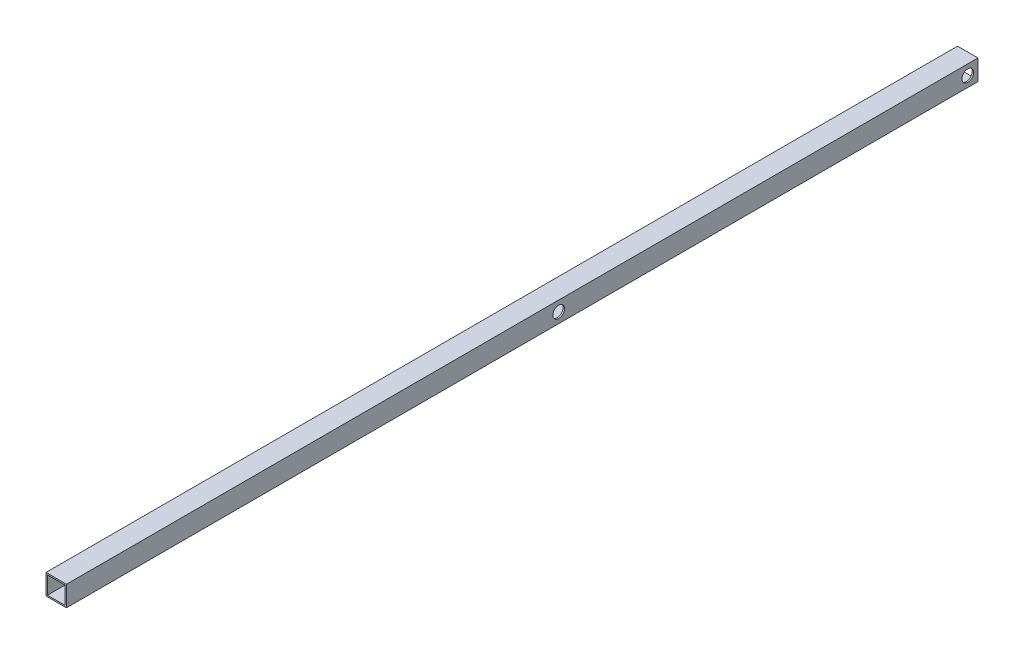
ISO-10303-21;
HEADER;
FILE_DESCRIPTION(('STEP AP214'),'2;1');
FILE_NAME('part.step','',(''),(''),'','','');
FILE_SCHEMA(('AUTOMOTIVE_DESIGN { 1 0 10303 214 1 1 1 1 }'));
ENDSEC;
DATA;
#1=APPLICATION_CONTEXT('core data for automotive mechanical design processes');
#2=APPLICATION_PROTOCOL_DEFINITION('international standard','automotive_design',2000,#1);
#3=PRODUCT_CONTEXT('',#1,'mechanical');
#4=PRODUCT('Part','Part','',(#3));
#5=PRODUCT_RELATED_PRODUCT_CATEGORY('part','',(#4));
#6=PRODUCT_DEFINITION_FORMATION('','',#4);
#7=PRODUCT_DEFINITION_CONTEXT('part definition',#1,'design');
#8=PRODUCT_DEFINITION('design','',#6,#7);
#9=PRODUCT_DEFINITION_SHAPE('','',#8);
#10=(LENGTH_UNIT() NAMED_UNIT(*) SI_UNIT(.MILLI.,.METRE.));
#11=(NAMED_UNIT(*) PLANE_ANGLE_UNIT() SI_UNIT($,.RADIAN.));
#12=(NAMED_UNIT(*) SI_UNIT($,.STERADIAN.) SOLID_ANGLE_UNIT());
#13=UNCERTAINTY_MEASURE_WITH_UNIT(LENGTH_MEASURE(1.E-05),#10,'distance_accuracy_value','');
#14=(GEOMETRIC_REPRESENTATION_CONTEXT(3) GLOBAL_UNCERTAINTY_ASSIGNED_CONTEXT((#13)) GLOBAL_UNIT_ASSIGNED_CONTEXT((#10,
#11,#12)) REPRESENTATION_CONTEXT('',''));
#15=CARTESIAN_POINT('',(0.,0.,0.));
#16=DIRECTION('',(0.,0.,1.));
#17=DIRECTION('',(1.,0.,0.));
#18=AXIS2_PLACEMENT_3D('',#15,#16,#17);
#19=CARTESIAN_POINT('',(13.1321710093077,0.25561907476954,911.225));
#20=DIRECTION('',(-1.,0.,0.));
#21=DIRECTION('',(0.,-1.,0.));
#22=AXIS2_PLACEMENT_3D('',#19,#20,#21);
#23=CYLINDRICAL_SURFACE('',#22,18.25625);
#24=CARTESIAN_POINT('',(-31.3178289906922,0.255619074769538,911.225));
#25=DIRECTION('',(-1.,0.,0.));
#26=DIRECTION('',(0.,-1.,0.));
#27=AXIS2_PLACEMENT_3D('',#24,#25,#26);
#28=CIRCLE('',#27,18.25625);
#29=CARTESIAN_POINT('',(-31.3178289906922,-18.0006309252305,911.225));
#30=VERTEX_POINT('',#29);
#31=EDGE_CURVE('E131',#30,#30,#28,.F.);
#32=ORIENTED_EDGE('',*,*,#31,.F.);
#33=EDGE_LOOP('',(#32));
#34=FACE_BOUND('',#33,.T.);
#35=CARTESIAN_POINT('',(-28.1428289906922,0.255619074769538,911.225));
#36=DIRECTION('',(-1.,0.,0.));
#37=DIRECTION('',(0.,-1.,0.));
#38=AXIS2_PLACEMENT_3D('',#35,#36,#37);
#39=CIRCLE('',#38,18.25625);
#40=CARTESIAN_POINT('',(-28.1428289906922,-18.0006309252305,911.225));
#41=VERTEX_POINT('',#40);
#42=EDGE_CURVE('E20',#41,#41,#39,.F.);
#43=ORIENTED_EDGE('',*,*,#42,.T.);
#44=EDGE_LOOP('',(#43));
#45=FACE_BOUND('',#44,.T.);
#46=ADVANCED_FACE('F17',(#34,#45),#23,.F.);
#47=CARTESIAN_POINT('',(13.1321710093077,0.25561907476954,22.225));
#48=DIRECTION('',(-1.,0.,0.));
#49=DIRECTION('',(0.,-1.,0.));
#50=AXIS2_PLACEMENT_3D('',#47,#48,#49);
#51=CYLINDRICAL_SURFACE('',#50,18.25625);
#52=CARTESIAN_POINT('',(-31.3178289906922,0.255619074769538,22.225));
#53=DIRECTION('',(-1.,0.,0.));
#54=DIRECTION('',(0.,-1.,0.));
#55=AXIS2_PLACEMENT_3D('',#52,#53,#54);
#56=CIRCLE('',#55,18.25625);
#57=CARTESIAN_POINT('',(-31.3178289906922,-18.0006309252305,22.225));
#58=VERTEX_POINT('',#57);
#59=EDGE_CURVE('E127',#58,#58,#56,.F.);
#60=ORIENTED_EDGE('',*,*,#59,.F.);
#61=EDGE_LOOP('',(#60));
#62=FACE_BOUND('',#61,.T.);
#63=CARTESIAN_POINT('',(-28.1428289906922,0.255619074769538,22.225));
#64=DIRECTION('',(-1.,0.,0.));
#65=DIRECTION('',(0.,-1.,0.));
#66=AXIS2_PLACEMENT_3D('',#63,#64,#65);
#67=CIRCLE('',#66,18.25625);
#68=CARTESIAN_POINT('',(-28.1428289906922,-18.0006309252305,22.225));
#69=VERTEX_POINT('',#68);
#70=EDGE_CURVE('E118',#69,#69,#67,.F.);
#71=ORIENTED_EDGE('',*,*,#70,.T.);
#72=EDGE_LOOP('',(#71));
#73=FACE_BOUND('',#72,.T.);
#74=ADVANCED_FACE('F149',(#62,#73),#51,.F.);
#75=CARTESIAN_POINT('',(-28.1428289906922,-21.9693809252305,0.));
#76=DIRECTION('',(-1.,0.,0.));
#77=DIRECTION('',(0.,0.,1.));
#78=AXIS2_PLACEMENT_3D('',#75,#76,#77);
#79=PLANE('',#78);
#80=ORIENTED_EDGE('',*,*,#70,.F.);
#81=EDGE_LOOP('',(#80));
#82=FACE_BOUND('',#81,.T.);
#83=ORIENTED_EDGE('',*,*,#42,.F.);
#84=EDGE_LOOP('',(#83));
#85=FACE_BOUND('',#84,.T.);
#86=DIRECTION('',(0.,1.,0.));
#87=VECTOR('',#86,1.);
#88=CARTESIAN_POINT('',(-28.1428289906922,0.25561907476954,0.));
#89=LINE('',#88,#87);
#90=CARTESIAN_POINT('',(-28.1428289906922,-18.7943809252305,0.));
#91=VERTEX_POINT('',#90);
#92=CARTESIAN_POINT('',(-28.1428289906922,19.3056190747695,0.));
#93=VERTEX_POINT('',#92);
#94=EDGE_CURVE('E106',#91,#93,#89,.T.);
#95=ORIENTED_EDGE('',*,*,#94,.T.);
#96=DIRECTION('',(0.,0.,1.));
#97=VECTOR('',#96,1.);
#98=CARTESIAN_POINT('',(-28.1428289906922,19.3056190747695,0.));
#99=LINE('',#98,#97);
#100=CARTESIAN_POINT('',(-28.1428289906922,19.3056190747695,1981.2));
#101=VERTEX_POINT('',#100);
#102=EDGE_CURVE('E116',#93,#101,#99,.T.);
#103=ORIENTED_EDGE('',*,*,#102,.T.);
#104=DIRECTION('',(0.,1.,0.));
#105=VECTOR('',#104,1.);
#106=CARTESIAN_POINT('',(-28.1428289906922,0.25561907476954,1981.2));
#107=LINE('',#106,#105);
#108=CARTESIAN_POINT('',(-28.1428289906922,-18.7943809252305,1981.2));
#109=VERTEX_POINT('',#108);
#110=EDGE_CURVE('E167',#109,#101,#107,.T.);
#111=ORIENTED_EDGE('',*,*,#110,.F.);
#112=DIRECTION('',(0.,0.,-1.));
#113=VECTOR('',#112,1.);
#114=CARTESIAN_POINT('',(-28.1428289906922,-18.7943809252305,0.));
#115=LINE('',#114,#113);
#116=EDGE_CURVE('E102',#109,#91,#115,.T.);
#117=ORIENTED_EDGE('',*,*,#116,.T.);
#118=EDGE_LOOP('',(#95,#103,#111,#117));
#119=FACE_BOUND('',#118,.T.);
#120=ADVANCED_FACE('F145',(#82,#85,#119),#79,.F.);
#121=CARTESIAN_POINT('',(-31.3178289906922,19.3056190747695,0.));
#122=DIRECTION('',(0.,1.,0.));
#123=DIRECTION('',(0.,0.,1.));
#124=AXIS2_PLACEMENT_3D('',#121,#122,#123);
#125=PLANE('',#124);
#126=DIRECTION('',(1.,0.,0.));
#127=VECTOR('',#126,1.);
#128=CARTESIAN_POINT('',(-9.09282899069231,19.3056190747695,0.));
#129=LINE('',#128,#127);
#130=CARTESIAN_POINT('',(9.95717100930769,19.3056190747695,0.));
#131=VERTEX_POINT('',#130);
#132=EDGE_CURVE('E108',#93,#131,#129,.T.);
#133=ORIENTED_EDGE('',*,*,#132,.T.);
#134=DIRECTION('',(0.,0.,-1.));
#135=VECTOR('',#134,1.);
#136=CARTESIAN_POINT('',(9.95717100930769,19.3056190747695,0.));
#137=LINE('',#136,#135);
#138=CARTESIAN_POINT('',(9.95717100930769,19.3056190747695,1981.2));
#139=VERTEX_POINT('',#138);
#140=EDGE_CURVE('E79',#131,#139,#137,.F.);
#141=ORIENTED_EDGE('',*,*,#140,.T.);
#142=DIRECTION('',(1.,0.,0.));
#143=VECTOR('',#142,1.);
#144=CARTESIAN_POINT('',(-9.09282899069231,19.3056190747695,1981.2));
#145=LINE('',#144,#143);
#146=EDGE_CURVE('E156',#101,#139,#145,.T.);
#147=ORIENTED_EDGE('',*,*,#146,.F.);
#148=ORIENTED_EDGE('',*,*,#102,.F.);
#149=EDGE_LOOP('',(#133,#141,#147,#148));
#150=FACE_BOUND('',#149,.T.);
#151=ADVANCED_FACE('F148',(#150),#125,.F.);
#152=CARTESIAN_POINT('',(9.95717100930769,22.4806190747695,0.));
#153=DIRECTION('',(1.,0.,0.));
#154=DIRECTION('',(0.,0.,-1.));
#155=AXIS2_PLACEMENT_3D('',#152,#153,#154);
#156=PLANE('',#155);
#157=CARTESIAN_POINT('',(9.95717100930769,0.25561907476954,22.225));
#158=DIRECTION('',(-1.,0.,0.));
#159=DIRECTION('',(0.,-1.,0.));
#160=AXIS2_PLACEMENT_3D('',#157,#158,#159);
#161=CIRCLE('',#160,12.7);
#162=CARTESIAN_POINT('',(9.95717100930769,-12.4443809252305,22.225));
#163=VERTEX_POINT('',#162);
#164=EDGE_CURVE('E112',#163,#163,#161,.F.);
#165=ORIENTED_EDGE('',*,*,#164,.T.);
#166=EDGE_LOOP('',(#165));
#167=FACE_BOUND('',#166,.T.);
#168=CARTESIAN_POINT('',(9.95717100930769,0.25561907476954,911.225));
#169=DIRECTION('',(-1.,0.,0.));
#170=DIRECTION('',(0.,-1.,0.));
#171=AXIS2_PLACEMENT_3D('',#168,#169,#170);
#172=CIRCLE('',#171,12.7);
#173=CARTESIAN_POINT('',(9.95717100930769,-12.4443809252305,911.225));
#174=VERTEX_POINT('',#173);
#175=EDGE_CURVE('E101',#174,#174,#172,.F.);
#176=ORIENTED_EDGE('',*,*,#175,.T.);
#177=EDGE_LOOP('',(#176));
#178=FACE_BOUND('',#177,.T.);
#179=DIRECTION('',(0.,1.,0.));
#180=VECTOR('',#179,1.);
#181=CARTESIAN_POINT('',(9.95717100930769,0.25561907476954,0.));
#182=LINE('',#181,#180);
#183=CARTESIAN_POINT('',(9.95717100930769,-18.7943809252305,0.));
#184=VERTEX_POINT('',#183);
#185=EDGE_CURVE('E82',#131,#184,#182,.F.);
#186=ORIENTED_EDGE('',*,*,#185,.T.);
#187=DIRECTION('',(0.,0.,-1.));
#188=VECTOR('',#187,1.);
#189=CARTESIAN_POINT('',(9.95717100930769,-18.7943809252305,0.));
#190=LINE('',#189,#188);
#191=CARTESIAN_POINT('',(9.95717100930769,-18.7943809252305,1981.2));
#192=VERTEX_POINT('',#191);
#193=EDGE_CURVE('E85',#184,#192,#190,.F.);
#194=ORIENTED_EDGE('',*,*,#193,.T.);
#195=DIRECTION('',(0.,1.,0.));
#196=VECTOR('',#195,1.);
#197=CARTESIAN_POINT('',(9.95717100930769,0.25561907476954,1981.2));
#198=LINE('',#197,#196);
#199=EDGE_CURVE('E170',#139,#192,#198,.F.);
#200=ORIENTED_EDGE('',*,*,#199,.F.);
#201=ORIENTED_EDGE('',*,*,#140,.F.);
#202=EDGE_LOOP('',(#186,#194,#200,#201));
#203=FACE_BOUND('',#202,.T.);
#204=ADVANCED_FACE('F84',(#167,#178,#203),#156,.F.);
#205=CARTESIAN_POINT('',(13.1321710093077,-18.7943809252305,0.));
#206=DIRECTION('',(0.,-1.,0.));
#207=DIRECTION('',(0.,0.,-1.));
#208=AXIS2_PLACEMENT_3D('',#205,#206,#207);
#209=PLANE('',#208);
#210=DIRECTION('',(1.,0.,0.));
#211=VECTOR('',#210,1.);
#212=CARTESIAN_POINT('',(-9.09282899069231,-18.7943809252305,0.));
#213=LINE('',#212,#211);
#214=EDGE_CURVE('E90',#184,#91,#213,.F.);
#215=ORIENTED_EDGE('',*,*,#214,.T.);
#216=ORIENTED_EDGE('',*,*,#116,.F.);
#217=DIRECTION('',(1.,0.,0.));
#218=VECTOR('',#217,1.);
#219=CARTESIAN_POINT('',(-9.09282899069231,-18.7943809252305,1981.2));
#220=LINE('',#219,#218);
#221=EDGE_CURVE('E99',#192,#109,#220,.F.);
#222=ORIENTED_EDGE('',*,*,#221,.F.);
#223=ORIENTED_EDGE('',*,*,#193,.F.);
#224=EDGE_LOOP('',(#215,#216,#222,#223));
#225=FACE_BOUND('',#224,.T.);
#226=ADVANCED_FACE('F95',(#225),#209,.F.);
#227=CARTESIAN_POINT('',(13.1321710093077,-21.9693809252305,0.));
#228=DIRECTION('',(0.,-1.,0.));
#229=DIRECTION('',(0.,0.,-1.));
#230=AXIS2_PLACEMENT_3D('',#227,#228,#229);
#231=PLANE('',#230);
#232=DIRECTION('',(1.,0.,0.));
#233=VECTOR('',#232,1.);
#234=CARTESIAN_POINT('',(-9.09282899069231,-21.9693809252305,1981.2));
#235=LINE('',#234,#233);
#236=CARTESIAN_POINT('',(-31.3178289906922,-21.9693809252305,1981.2));
#237=VERTEX_POINT('',#236);
#238=CARTESIAN_POINT('',(13.1321710093077,-21.9693809252305,1981.2));
#239=VERTEX_POINT('',#238);
#240=EDGE_CURVE('E165',#237,#239,#235,.T.);
#241=ORIENTED_EDGE('',*,*,#240,.F.);
#242=DIRECTION('',(0.,0.,1.));
#243=VECTOR('',#242,1.);
#244=CARTESIAN_POINT('',(-31.3178289906922,-21.9693809252305,0.));
#245=LINE('',#244,#243);
#246=CARTESIAN_POINT('',(-31.3178289906922,-21.9693809252305,0.));
#247=VERTEX_POINT('',#246);
#248=EDGE_CURVE('E134',#247,#237,#245,.T.);
#249=ORIENTED_EDGE('',*,*,#248,.F.);
#250=DIRECTION('',(1.,0.,0.));
#251=VECTOR('',#250,1.);
#252=CARTESIAN_POINT('',(-9.09282899069231,-21.9693809252305,0.));
#253=LINE('',#252,#251);
#254=CARTESIAN_POINT('',(13.1321710093077,-21.9693809252305,0.));
#255=VERTEX_POINT('',#254);
#256=EDGE_CURVE('E91',#247,#255,#253,.T.);
#257=ORIENTED_EDGE('',*,*,#256,.T.);
#258=DIRECTION('',(0.,0.,-1.));
#259=VECTOR('',#258,1.);
#260=CARTESIAN_POINT('',(13.1321710093077,-21.9693809252305,0.));
#261=LINE('',#260,#259);
#262=EDGE_CURVE('E126',#239,#255,#261,.T.);
#263=ORIENTED_EDGE('',*,*,#262,.F.);
#264=EDGE_LOOP('',(#241,#249,#257,#263));
#265=FACE_BOUND('',#264,.T.);
#266=ADVANCED_FACE('F195',(#265),#231,.T.);
#267=CARTESIAN_POINT('',(13.1321710093077,0.25561907476954,911.225));
#268=DIRECTION('',(-1.,0.,0.));
#269=DIRECTION('',(0.,-1.,0.));
#270=AXIS2_PLACEMENT_3D('',#267,#268,#269);
#271=CYLINDRICAL_SURFACE('',#270,12.7);
#272=ORIENTED_EDGE('',*,*,#175,.F.);
#273=EDGE_LOOP('',(#272));
#274=FACE_BOUND('',#273,.T.);
#275=CARTESIAN_POINT('',(13.1321710093077,0.25561907476954,911.225));
#276=DIRECTION('',(-1.,0.,0.));
#277=DIRECTION('',(0.,-1.,0.));
#278=AXIS2_PLACEMENT_3D('',#275,#276,#277);
#279=CIRCLE('',#278,12.7);
#280=CARTESIAN_POINT('',(13.1321710093077,-12.4443809252305,911.225));
#281=VERTEX_POINT('',#280);
#282=EDGE_CURVE('E123',#281,#281,#279,.T.);
#283=ORIENTED_EDGE('',*,*,#282,.F.);
#284=EDGE_LOOP('',(#283));
#285=FACE_BOUND('',#284,.T.);
#286=ADVANCED_FACE('F209',(#274,#285),#271,.F.);
#287=CARTESIAN_POINT('',(13.1321710093077,0.25561907476954,22.225));
#288=DIRECTION('',(-1.,0.,0.));
#289=DIRECTION('',(0.,-1.,0.));
#290=AXIS2_PLACEMENT_3D('',#287,#288,#289);
#291=CYLINDRICAL_SURFACE('',#290,12.7);
#292=ORIENTED_EDGE('',*,*,#164,.F.);
#293=EDGE_LOOP('',(#292));
#294=FACE_BOUND('',#293,.T.);
#295=CARTESIAN_POINT('',(13.1321710093077,0.25561907476954,22.225));
#296=DIRECTION('',(-1.,0.,0.));
#297=DIRECTION('',(0.,-1.,0.));
#298=AXIS2_PLACEMENT_3D('',#295,#296,#297);
#299=CIRCLE('',#298,12.7);
#300=CARTESIAN_POINT('',(13.1321710093077,-12.4443809252305,22.225));
#301=VERTEX_POINT('',#300);
#302=EDGE_CURVE('E119',#301,#301,#299,.T.);
#303=ORIENTED_EDGE('',*,*,#302,.F.);
#304=EDGE_LOOP('',(#303));
#305=FACE_BOUND('',#304,.T.);
#306=ADVANCED_FACE('F200',(#294,#305),#291,.F.);
#307=CARTESIAN_POINT('',(-9.09282899069231,0.25561907476954,0.));
#308=DIRECTION('',(0.,0.,1.));
#309=DIRECTION('',(1.,0.,0.));
#310=AXIS2_PLACEMENT_3D('',#307,#308,#309);
#311=PLANE('',#310);
#312=ORIENTED_EDGE('',*,*,#94,.F.);
#313=ORIENTED_EDGE('',*,*,#214,.F.);
#314=ORIENTED_EDGE('',*,*,#185,.F.);
#315=ORIENTED_EDGE('',*,*,#132,.F.);
#316=EDGE_LOOP('',(#312,#313,#314,#315));
#317=FACE_BOUND('',#316,.T.);
#318=ORIENTED_EDGE('',*,*,#256,.F.);
#319=DIRECTION('',(0.,1.,0.));
#320=VECTOR('',#319,1.);
#321=CARTESIAN_POINT('',(-31.3178289906922,-21.9693809252305,0.));
#322=LINE('',#321,#320);
#323=CARTESIAN_POINT('',(-31.3178289906922,22.4806190747695,0.));
#324=VERTEX_POINT('',#323);
#325=EDGE_CURVE('E158',#324,#247,#322,.F.);
#326=ORIENTED_EDGE('',*,*,#325,.F.);
#327=DIRECTION('',(1.,0.,0.));
#328=VECTOR('',#327,1.);
#329=CARTESIAN_POINT('',(-31.3178289906922,22.4806190747695,0.));
#330=LINE('',#329,#328);
#331=CARTESIAN_POINT('',(13.1321710093077,22.4806190747695,0.));
#332=VERTEX_POINT('',#331);
#333=EDGE_CURVE('E122',#332,#324,#330,.F.);
#334=ORIENTED_EDGE('',*,*,#333,.F.);
#335=DIRECTION('',(0.,1.,0.));
#336=VECTOR('',#335,1.);
#337=CARTESIAN_POINT('',(13.1321710093077,22.4806190747695,0.));
#338=LINE('',#337,#336);
#339=EDGE_CURVE('E173',#255,#332,#338,.T.);
#340=ORIENTED_EDGE('',*,*,#339,.F.);
#341=EDGE_LOOP('',(#318,#326,#334,#340));
#342=FACE_BOUND('',#341,.T.);
#343=ADVANCED_FACE('F104',(#317,#342),#311,.F.);
#344=CARTESIAN_POINT('',(-31.3178289906922,-21.9693809252305,0.));
#345=DIRECTION('',(-1.,0.,0.));
#346=DIRECTION('',(0.,0.,1.));
#347=AXIS2_PLACEMENT_3D('',#344,#345,#346);
#348=PLANE('',#347);
#349=ORIENTED_EDGE('',*,*,#59,.T.);
#350=EDGE_LOOP('',(#349));
#351=FACE_BOUND('',#350,.T.);
#352=ORIENTED_EDGE('',*,*,#31,.T.);
#353=EDGE_LOOP('',(#352));
#354=FACE_BOUND('',#353,.T.);
#355=DIRECTION('',(0.,1.,0.));
#356=VECTOR('',#355,1.);
#357=CARTESIAN_POINT('',(-31.3178289906922,0.25561907476954,1981.2));
#358=LINE('',#357,#356);
#359=CARTESIAN_POINT('',(-31.3178289906922,22.4806190747695,1981.2));
#360=VERTEX_POINT('',#359);
#361=EDGE_CURVE('E130',#360,#237,#358,.F.);
#362=ORIENTED_EDGE('',*,*,#361,.F.);
#363=DIRECTION('',(0.,0.,1.));
#364=VECTOR('',#363,1.);
#365=CARTESIAN_POINT('',(-31.3178289906922,22.4806190747695,0.));
#366=LINE('',#365,#364);
#367=EDGE_CURVE('E181',#324,#360,#366,.T.);
#368=ORIENTED_EDGE('',*,*,#367,.F.);
#369=ORIENTED_EDGE('',*,*,#325,.T.);
#370=ORIENTED_EDGE('',*,*,#248,.T.);
#371=EDGE_LOOP('',(#362,#368,#369,#370));
#372=FACE_BOUND('',#371,.T.);
#373=ADVANCED_FACE('F192',(#351,#354,#372),#348,.T.);
#374=CARTESIAN_POINT('',(-9.09282899069231,0.25561907476954,1981.2));
#375=DIRECTION('',(0.,0.,1.));
#376=DIRECTION('',(1.,0.,0.));
#377=AXIS2_PLACEMENT_3D('',#374,#375,#376);
#378=PLANE('',#377);
#379=ORIENTED_EDGE('',*,*,#199,.T.);
#380=ORIENTED_EDGE('',*,*,#221,.T.);
#381=ORIENTED_EDGE('',*,*,#110,.T.);
#382=ORIENTED_EDGE('',*,*,#146,.T.);
#383=EDGE_LOOP('',(#379,#380,#381,#382));
#384=FACE_BOUND('',#383,.T.);
#385=DIRECTION('',(0.,1.,0.));
#386=VECTOR('',#385,1.);
#387=CARTESIAN_POINT('',(13.1321710093077,22.4806190747695,1981.2));
#388=LINE('',#387,#386);
#389=CARTESIAN_POINT('',(13.1321710093077,22.4806190747695,1981.2));
#390=VERTEX_POINT('',#389);
#391=EDGE_CURVE('E35',#390,#239,#388,.F.);
#392=ORIENTED_EDGE('',*,*,#391,.F.);
#393=DIRECTION('',(1.,0.,0.));
#394=VECTOR('',#393,1.);
#395=CARTESIAN_POINT('',(-31.3178289906922,22.4806190747695,1981.2));
#396=LINE('',#395,#394);
#397=EDGE_CURVE('E26',#360,#390,#396,.T.);
#398=ORIENTED_EDGE('',*,*,#397,.F.);
#399=ORIENTED_EDGE('',*,*,#361,.T.);
#400=ORIENTED_EDGE('',*,*,#240,.T.);
#401=EDGE_LOOP('',(#392,#398,#399,#400));
#402=FACE_BOUND('',#401,.T.);
#403=ADVANCED_FACE('F188',(#384,#402),#378,.T.);
#404=CARTESIAN_POINT('',(13.1321710093077,22.4806190747695,0.));
#405=DIRECTION('',(1.,0.,0.));
#406=DIRECTION('',(0.,0.,-1.));
#407=AXIS2_PLACEMENT_3D('',#404,#405,#406);
#408=PLANE('',#407);
#409=ORIENTED_EDGE('',*,*,#302,.T.);
#410=EDGE_LOOP('',(#409));
#411=FACE_BOUND('',#410,.T.);
#412=ORIENTED_EDGE('',*,*,#282,.T.);
#413=EDGE_LOOP('',(#412));
#414=FACE_BOUND('',#413,.T.);
#415=ORIENTED_EDGE('',*,*,#391,.T.);
#416=ORIENTED_EDGE('',*,*,#262,.T.);
#417=ORIENTED_EDGE('',*,*,#339,.T.);
#418=DIRECTION('',(0.,0.,1.));
#419=VECTOR('',#418,1.);
#420=CARTESIAN_POINT('',(13.1321710093077,22.4806190747695,0.));
#421=LINE('',#420,#419);
#422=EDGE_CURVE('E11',#390,#332,#421,.F.);
#423=ORIENTED_EDGE('',*,*,#422,.F.);
#424=EDGE_LOOP('',(#415,#416,#417,#423));
#425=FACE_BOUND('',#424,.T.);
#426=ADVANCED_FACE('F198',(#411,#414,#425),#408,.T.);
#427=CARTESIAN_POINT('',(-31.3178289906922,22.4806190747695,0.));
#428=DIRECTION('',(0.,1.,0.));
#429=DIRECTION('',(0.,0.,1.));
#430=AXIS2_PLACEMENT_3D('',#427,#428,#429);
#431=PLANE('',#430);
#432=ORIENTED_EDGE('',*,*,#397,.T.);
#433=ORIENTED_EDGE('',*,*,#422,.T.);
#434=ORIENTED_EDGE('',*,*,#333,.T.);
#435=ORIENTED_EDGE('',*,*,#367,.T.);
#436=EDGE_LOOP('',(#432,#433,#434,#435));
#437=FACE_BOUND('',#436,.T.);
#438=ADVANCED_FACE('F186',(#437),#431,.T.);
#439=CLOSED_SHELL('',(#46,#74,#120,#151,#204,#226,#266,#286,#306,#343,#373,#403,#426,#438));
#440=MANIFOLD_SOLID_BREP('B1',#439);
#441=ADVANCED_BREP_SHAPE_REPRESENTATION('',(#18,#440),#14);
#442=SHAPE_DEFINITION_REPRESENTATION(#9,#441);
ENDSEC;
END-ISO-10303-21;
